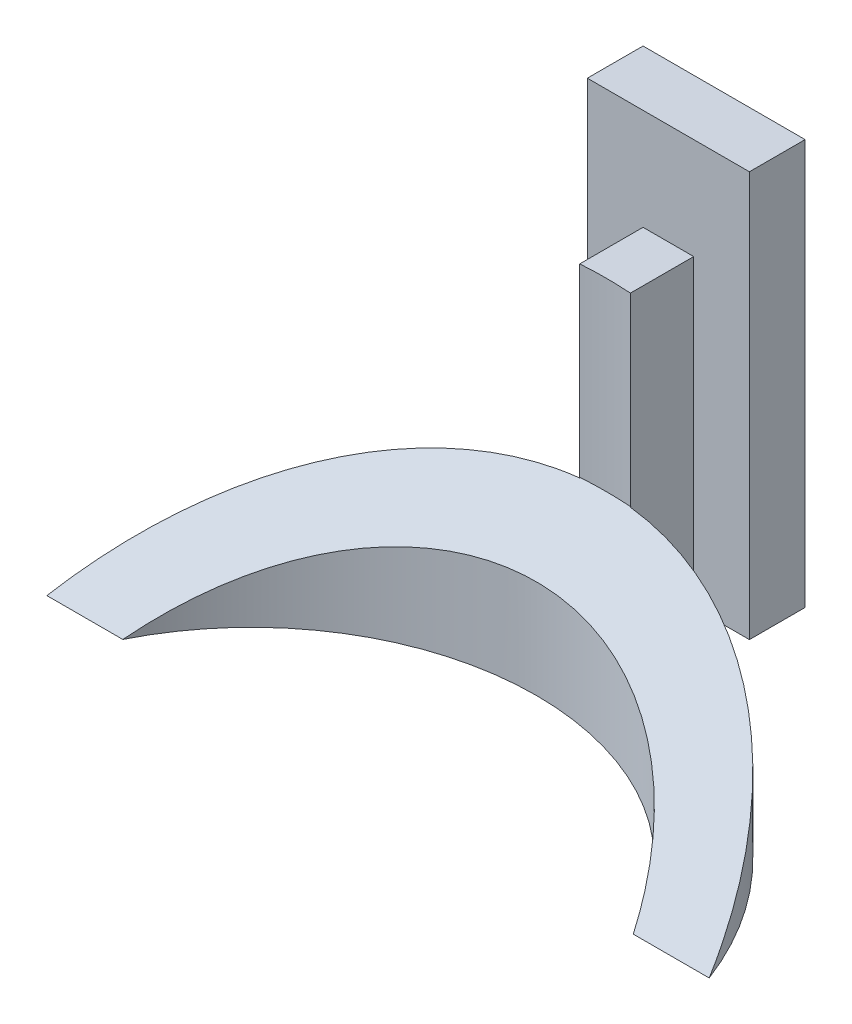
ISO-10303-21;
HEADER;
FILE_DESCRIPTION(('STEP AP214'),'2;1');
FILE_NAME('part.step','',(''),(''),'','','');
FILE_SCHEMA(('AUTOMOTIVE_DESIGN { 1 0 10303 214 1 1 1 1 }'));
ENDSEC;
DATA;
#1=APPLICATION_CONTEXT('core data for automotive mechanical design processes');
#2=APPLICATION_PROTOCOL_DEFINITION('international standard','automotive_design',2000,#1);
#3=PRODUCT_CONTEXT('',#1,'mechanical');
#4=PRODUCT('Part','Part','',(#3));
#5=PRODUCT_RELATED_PRODUCT_CATEGORY('part','',(#4));
#6=PRODUCT_DEFINITION_FORMATION('','',#4);
#7=PRODUCT_DEFINITION_CONTEXT('part definition',#1,'design');
#8=PRODUCT_DEFINITION('design','',#6,#7);
#9=PRODUCT_DEFINITION_SHAPE('','',#8);
#10=(LENGTH_UNIT() NAMED_UNIT(*) SI_UNIT(.MILLI.,.METRE.));
#11=(NAMED_UNIT(*) PLANE_ANGLE_UNIT() SI_UNIT($,.RADIAN.));
#12=(NAMED_UNIT(*) SI_UNIT($,.STERADIAN.) SOLID_ANGLE_UNIT());
#13=UNCERTAINTY_MEASURE_WITH_UNIT(LENGTH_MEASURE(1.E-05),#10,'distance_accuracy_value','');
#14=(GEOMETRIC_REPRESENTATION_CONTEXT(3) GLOBAL_UNCERTAINTY_ASSIGNED_CONTEXT((#13)) GLOBAL_UNIT_ASSIGNED_CONTEXT((#10,
#11,#12)) REPRESENTATION_CONTEXT('',''));
#15=CARTESIAN_POINT('',(0.,0.,0.));
#16=DIRECTION('',(0.,0.,1.));
#17=DIRECTION('',(1.,0.,0.));
#18=AXIS2_PLACEMENT_3D('',#15,#16,#17);
#19=CARTESIAN_POINT('',(-2.5,30.,0.));
#20=DIRECTION('',(1.,0.,0.));
#21=DIRECTION('',(0.,0.,-1.));
#22=AXIS2_PLACEMENT_3D('',#19,#20,#21);
#23=PLANE('',#22);
#24=DIRECTION('',(0.,0.,1.));
#25=VECTOR('',#24,1.);
#26=CARTESIAN_POINT('',(-2.5,30.,0.));
#27=LINE('',#26,#25);
#28=CARTESIAN_POINT('',(-2.5,30.,3.));
#29=VERTEX_POINT('',#28);
#30=CARTESIAN_POINT('',(-2.5,30.,9.25));
#31=VERTEX_POINT('',#30);
#32=EDGE_CURVE('E97',#29,#31,#27,.T.);
#33=ORIENTED_EDGE('',*,*,#32,.F.);
#34=DIRECTION('',(0.,-1.,0.));
#35=VECTOR('',#34,1.);
#36=CARTESIAN_POINT('',(-2.5,30.,3.));
#37=LINE('',#36,#35);
#38=CARTESIAN_POINT('',(-2.5,0.,3.));
#39=VERTEX_POINT('',#38);
#40=EDGE_CURVE('E180',#29,#39,#37,.T.);
#41=ORIENTED_EDGE('',*,*,#40,.T.);
#42=DIRECTION('',(0.,0.,1.));
#43=VECTOR('',#42,1.);
#44=CARTESIAN_POINT('',(-2.5,0.,0.));
#45=LINE('',#44,#43);
#46=CARTESIAN_POINT('',(-2.5,0.,9.25));
#47=VERTEX_POINT('',#46);
#48=EDGE_CURVE('E104',#39,#47,#45,.T.);
#49=ORIENTED_EDGE('',*,*,#48,.T.);
#50=DIRECTION('',(0.,-1.,0.));
#51=VECTOR('',#50,1.);
#52=CARTESIAN_POINT('',(-2.5,11.7500000000677,9.25));
#53=LINE('',#52,#51);
#54=CARTESIAN_POINT('',(-2.5,11.6943734014861,9.25));
#55=VERTEX_POINT('',#54);
#56=EDGE_CURVE('E105',#55,#47,#53,.T.);
#57=ORIENTED_EDGE('',*,*,#56,.F.);
#58=DIRECTION('',(0.,0.528301886792453,-0.849056603773585));
#59=VECTOR('',#58,1.);
#60=CARTESIAN_POINT('',(-2.5,20.9526899743715,-5.62943734927998));
#61=LINE('',#60,#59);
#62=CARTESIAN_POINT('',(-2.5,11.7500000000678,9.16060010942235));
#63=VERTEX_POINT('',#62);
#64=EDGE_CURVE('E199',#55,#63,#61,.T.);
#65=ORIENTED_EDGE('',*,*,#64,.T.);
#66=DIRECTION('',(0.,0.,-1.));
#67=VECTOR('',#66,1.);
#68=CARTESIAN_POINT('',(-2.5,11.7500000000678,0.));
#69=LINE('',#68,#67);
#70=CARTESIAN_POINT('',(-2.5,11.7500000000678,9.24999999999999));
#71=VERTEX_POINT('',#70);
#72=EDGE_CURVE('E203',#71,#63,#69,.T.);
#73=ORIENTED_EDGE('',*,*,#72,.F.);
#74=DIRECTION('',(0.,-1.,0.));
#75=VECTOR('',#74,1.);
#76=CARTESIAN_POINT('',(-2.5,30.,9.25));
#77=LINE('',#76,#75);
#78=EDGE_CURVE('E11',#31,#71,#77,.T.);
#79=ORIENTED_EDGE('',*,*,#78,.F.);
#80=EDGE_LOOP('',(#33,#41,#49,#57,#65,#73,#79));
#81=FACE_BOUND('',#80,.T.);
#82=ADVANCED_FACE('F39',(#81),#23,.F.);
#83=CARTESIAN_POINT('',(2.5,30.,0.));
#84=DIRECTION('',(-1.,0.,0.));
#85=DIRECTION('',(0.,0.,1.));
#86=AXIS2_PLACEMENT_3D('',#83,#84,#85);
#87=PLANE('',#86);
#88=DIRECTION('',(0.,0.,-1.));
#89=VECTOR('',#88,1.);
#90=CARTESIAN_POINT('',(2.5,0.,0.));
#91=LINE('',#90,#89);
#92=CARTESIAN_POINT('',(2.5,0.,9.24999999999999));
#93=VERTEX_POINT('',#92);
#94=CARTESIAN_POINT('',(2.5,0.,3.));
#95=VERTEX_POINT('',#94);
#96=EDGE_CURVE('E117',#93,#95,#91,.T.);
#97=ORIENTED_EDGE('',*,*,#96,.T.);
#98=DIRECTION('',(0.,1.,0.));
#99=VECTOR('',#98,1.);
#100=CARTESIAN_POINT('',(2.5,30.,3.));
#101=LINE('',#100,#99);
#102=CARTESIAN_POINT('',(2.5,30.,3.));
#103=VERTEX_POINT('',#102);
#104=EDGE_CURVE('E172',#95,#103,#101,.T.);
#105=ORIENTED_EDGE('',*,*,#104,.T.);
#106=DIRECTION('',(0.,0.,-1.));
#107=VECTOR('',#106,1.);
#108=CARTESIAN_POINT('',(2.5,30.,0.));
#109=LINE('',#108,#107);
#110=CARTESIAN_POINT('',(2.5,30.,9.25));
#111=VERTEX_POINT('',#110);
#112=EDGE_CURVE('E91',#111,#103,#109,.T.);
#113=ORIENTED_EDGE('',*,*,#112,.F.);
#114=DIRECTION('',(0.,-1.,0.));
#115=VECTOR('',#114,1.);
#116=CARTESIAN_POINT('',(2.5,30.,9.25));
#117=LINE('',#116,#115);
#118=CARTESIAN_POINT('',(2.5,11.7500000000678,9.25));
#119=VERTEX_POINT('',#118);
#120=EDGE_CURVE('E48',#111,#119,#117,.T.);
#121=ORIENTED_EDGE('',*,*,#120,.T.);
#122=DIRECTION('',(0.,0.,1.));
#123=VECTOR('',#122,1.);
#124=CARTESIAN_POINT('',(2.5,11.7500000000678,0.));
#125=LINE('',#124,#123);
#126=CARTESIAN_POINT('',(2.5,11.7500000000678,9.16060010942235));
#127=VERTEX_POINT('',#126);
#128=EDGE_CURVE('E128',#127,#119,#125,.T.);
#129=ORIENTED_EDGE('',*,*,#128,.F.);
#130=DIRECTION('',(0.,-0.528301886792453,0.849056603773585));
#131=VECTOR('',#130,1.);
#132=CARTESIAN_POINT('',(2.50000000000001,20.9526899743715,-5.62943734927997));
#133=LINE('',#132,#131);
#134=CARTESIAN_POINT('',(2.5,11.6943734014862,9.24999999999999));
#135=VERTEX_POINT('',#134);
#136=EDGE_CURVE('E157',#127,#135,#133,.T.);
#137=ORIENTED_EDGE('',*,*,#136,.T.);
#138=DIRECTION('',(0.,-1.,0.));
#139=VECTOR('',#138,1.);
#140=CARTESIAN_POINT('',(2.5,11.7500000000677,9.24999999999999));
#141=LINE('',#140,#139);
#142=EDGE_CURVE('E110',#93,#135,#141,.F.);
#143=ORIENTED_EDGE('',*,*,#142,.F.);
#144=EDGE_LOOP('',(#97,#105,#113,#121,#129,#137,#143));
#145=FACE_BOUND('',#144,.T.);
#146=ADVANCED_FACE('F124',(#145),#87,.F.);
#147=CARTESIAN_POINT('',(-8.,30.,0.));
#148=DIRECTION('',(-1.,0.,0.));
#149=DIRECTION('',(0.,0.,1.));
#150=AXIS2_PLACEMENT_3D('',#147,#148,#149);
#151=PLANE('',#150);
#152=DIRECTION('',(0.,0.,-1.));
#153=VECTOR('',#152,1.);
#154=CARTESIAN_POINT('',(-8.,0.,0.));
#155=LINE('',#154,#153);
#156=CARTESIAN_POINT('',(-8.,0.,3.));
#157=VERTEX_POINT('',#156);
#158=CARTESIAN_POINT('',(-8.,0.,-2.5));
#159=VERTEX_POINT('',#158);
#160=EDGE_CURVE('E82',#157,#159,#155,.T.);
#161=ORIENTED_EDGE('',*,*,#160,.F.);
#162=DIRECTION('',(0.,1.,0.));
#163=VECTOR('',#162,1.);
#164=CARTESIAN_POINT('',(-8.,-16.0078105935821,3.));
#165=LINE('',#164,#163);
#166=CARTESIAN_POINT('',(-8.,40.,3.));
#167=VERTEX_POINT('',#166);
#168=EDGE_CURVE('E176',#157,#167,#165,.T.);
#169=ORIENTED_EDGE('',*,*,#168,.T.);
#170=DIRECTION('',(0.,0.,1.));
#171=VECTOR('',#170,1.);
#172=CARTESIAN_POINT('',(-8.,40.,0.));
#173=LINE('',#172,#171);
#174=CARTESIAN_POINT('',(-8.,40.,-2.5));
#175=VERTEX_POINT('',#174);
#176=EDGE_CURVE('E86',#175,#167,#173,.T.);
#177=ORIENTED_EDGE('',*,*,#176,.F.);
#178=DIRECTION('',(0.,-1.,0.));
#179=VECTOR('',#178,1.);
#180=CARTESIAN_POINT('',(-8.,30.,-2.5));
#181=LINE('',#180,#179);
#182=EDGE_CURVE('E77',#175,#159,#181,.T.);
#183=ORIENTED_EDGE('',*,*,#182,.T.);
#184=EDGE_LOOP('',(#161,#169,#177,#183));
#185=FACE_BOUND('',#184,.T.);
#186=ADVANCED_FACE('F41',(#185),#151,.T.);
#187=CARTESIAN_POINT('',(0.,30.,44.1606001094224));
#188=DIRECTION('',(0.,-1.,0.));
#189=DIRECTION('',(0.,0.,-1.));
#190=AXIS2_PLACEMENT_3D('',#187,#188,#189);
#191=CYLINDRICAL_SURFACE('',#190,35.);
#192=CARTESIAN_POINT('',(0.,11.7500000000677,44.1606001094224));
#193=DIRECTION('',(0.,1.,0.));
#194=DIRECTION('',(0.,0.,1.));
#195=AXIS2_PLACEMENT_3D('',#192,#193,#194);
#196=CIRCLE('',#195,35.);
#197=CARTESIAN_POINT('',(0.,11.7500000000678,9.16060010942235));
#198=VERTEX_POINT('',#197);
#199=EDGE_CURVE('E158',#119,#198,#196,.T.);
#200=ORIENTED_EDGE('',*,*,#199,.F.);
#201=ORIENTED_EDGE('',*,*,#120,.F.);
#202=CARTESIAN_POINT('',(0.,30.,44.1606001094224));
#203=DIRECTION('',(0.,1.,0.));
#204=DIRECTION('',(0.,0.,1.));
#205=AXIS2_PLACEMENT_3D('',#202,#203,#204);
#206=CIRCLE('',#205,35.);
#207=EDGE_CURVE('E219',#111,#31,#206,.T.);
#208=ORIENTED_EDGE('',*,*,#207,.T.);
#209=ORIENTED_EDGE('',*,*,#78,.T.);
#210=EDGE_CURVE('E207',#198,#71,#196,.T.);
#211=ORIENTED_EDGE('',*,*,#210,.F.);
#212=EDGE_LOOP('',(#200,#201,#208,#209,#211));
#213=FACE_BOUND('',#212,.T.);
#214=ADVANCED_FACE('F272',(#213),#191,.F.);
#215=CARTESIAN_POINT('',(8.,30.,0.));
#216=DIRECTION('',(-1.,0.,0.));
#217=DIRECTION('',(0.,0.,1.));
#218=AXIS2_PLACEMENT_3D('',#215,#216,#217);
#219=PLANE('',#218);
#220=DIRECTION('',(0.,0.,-1.));
#221=VECTOR('',#220,1.);
#222=CARTESIAN_POINT('',(8.,0.,0.));
#223=LINE('',#222,#221);
#224=CARTESIAN_POINT('',(8.,0.,3.));
#225=VERTEX_POINT('',#224);
#226=CARTESIAN_POINT('',(8.,0.,-2.5));
#227=VERTEX_POINT('',#226);
#228=EDGE_CURVE('E70',#225,#227,#223,.T.);
#229=ORIENTED_EDGE('',*,*,#228,.T.);
#230=DIRECTION('',(0.,-1.,0.));
#231=VECTOR('',#230,1.);
#232=CARTESIAN_POINT('',(8.,30.,-2.5));
#233=LINE('',#232,#231);
#234=CARTESIAN_POINT('',(8.,40.,-2.5));
#235=VERTEX_POINT('',#234);
#236=EDGE_CURVE('E90',#235,#227,#233,.T.);
#237=ORIENTED_EDGE('',*,*,#236,.F.);
#238=DIRECTION('',(0.,0.,1.));
#239=VECTOR('',#238,1.);
#240=CARTESIAN_POINT('',(8.,40.,0.));
#241=LINE('',#240,#239);
#242=CARTESIAN_POINT('',(8.,40.,3.));
#243=VERTEX_POINT('',#242);
#244=EDGE_CURVE('E183',#235,#243,#241,.T.);
#245=ORIENTED_EDGE('',*,*,#244,.T.);
#246=DIRECTION('',(0.,1.,0.));
#247=VECTOR('',#246,1.);
#248=CARTESIAN_POINT('',(8.,-16.0078105935821,3.));
#249=LINE('',#248,#247);
#250=EDGE_CURVE('E174',#225,#243,#249,.T.);
#251=ORIENTED_EDGE('',*,*,#250,.F.);
#252=EDGE_LOOP('',(#229,#237,#245,#251));
#253=FACE_BOUND('',#252,.T.);
#254=ADVANCED_FACE('F270',(#253),#219,.F.);
#255=CARTESIAN_POINT('',(0.,30.,-2.5));
#256=DIRECTION('',(0.,0.,1.));
#257=DIRECTION('',(1.,0.,0.));
#258=AXIS2_PLACEMENT_3D('',#255,#256,#257);
#259=PLANE('',#258);
#260=DIRECTION('',(-1.,0.,0.));
#261=VECTOR('',#260,1.);
#262=CARTESIAN_POINT('',(0.,0.,-2.5));
#263=LINE('',#262,#261);
#264=EDGE_CURVE('E94',#227,#159,#263,.T.);
#265=ORIENTED_EDGE('',*,*,#264,.T.);
#266=ORIENTED_EDGE('',*,*,#182,.F.);
#267=DIRECTION('',(1.,0.,0.));
#268=VECTOR('',#267,1.);
#269=CARTESIAN_POINT('',(0.,40.,-2.5));
#270=LINE('',#269,#268);
#271=EDGE_CURVE('E187',#175,#235,#270,.T.);
#272=ORIENTED_EDGE('',*,*,#271,.T.);
#273=ORIENTED_EDGE('',*,*,#236,.T.);
#274=EDGE_LOOP('',(#265,#266,#272,#273));
#275=FACE_BOUND('',#274,.T.);
#276=ADVANCED_FACE('F95',(#275),#259,.F.);
#277=CARTESIAN_POINT('',(0.,30.,0.));
#278=DIRECTION('',(0.,1.,0.));
#279=DIRECTION('',(0.,0.,1.));
#280=AXIS2_PLACEMENT_3D('',#277,#278,#279);
#281=PLANE('',#280);
#282=DIRECTION('',(1.,0.,0.));
#283=VECTOR('',#282,1.);
#284=CARTESIAN_POINT('',(0.,30.,3.));
#285=LINE('',#284,#283);
#286=EDGE_CURVE('E169',#29,#103,#285,.T.);
#287=ORIENTED_EDGE('',*,*,#286,.F.);
#288=ORIENTED_EDGE('',*,*,#32,.T.);
#289=ORIENTED_EDGE('',*,*,#207,.F.);
#290=ORIENTED_EDGE('',*,*,#112,.T.);
#291=EDGE_LOOP('',(#287,#288,#289,#290));
#292=FACE_BOUND('',#291,.T.);
#293=ADVANCED_FACE('F223',(#292),#281,.T.);
#294=CARTESIAN_POINT('',(0.,0.,0.));
#295=DIRECTION('',(0.,1.,0.));
#296=DIRECTION('',(0.,0.,1.));
#297=AXIS2_PLACEMENT_3D('',#294,#295,#296);
#298=PLANE('',#297);
#299=ORIENTED_EDGE('',*,*,#48,.F.);
#300=DIRECTION('',(-1.,0.,0.));
#301=VECTOR('',#300,1.);
#302=CARTESIAN_POINT('',(8.,0.,3.));
#303=LINE('',#302,#301);
#304=EDGE_CURVE('E102',#39,#157,#303,.T.);
#305=ORIENTED_EDGE('',*,*,#304,.T.);
#306=ORIENTED_EDGE('',*,*,#160,.T.);
#307=ORIENTED_EDGE('',*,*,#264,.F.);
#308=ORIENTED_EDGE('',*,*,#228,.F.);
#309=EDGE_CURVE('E162',#225,#95,#303,.T.);
#310=ORIENTED_EDGE('',*,*,#309,.T.);
#311=ORIENTED_EDGE('',*,*,#96,.F.);
#312=CARTESIAN_POINT('',(0.,0.,44.1606001094224));
#313=DIRECTION('',(0.,1.,0.));
#314=DIRECTION('',(0.,0.,1.));
#315=AXIS2_PLACEMENT_3D('',#312,#313,#314);
#316=CIRCLE('',#315,35.);
#317=EDGE_CURVE('E107',#93,#47,#316,.T.);
#318=ORIENTED_EDGE('',*,*,#317,.T.);
#319=EDGE_LOOP('',(#299,#305,#306,#307,#308,#310,#311,#318));
#320=FACE_BOUND('',#319,.T.);
#321=ADVANCED_FACE('F100',(#320),#298,.F.);
#322=CARTESIAN_POINT('',(0.,11.7500000000677,44.1606001094224));
#323=DIRECTION('',(0.,-1.,0.));
#324=DIRECTION('',(0.,0.,-1.));
#325=AXIS2_PLACEMENT_3D('',#322,#323,#324);
#326=CYLINDRICAL_SURFACE('',#325,35.);
#327=CARTESIAN_POINT('',(0.,-2.24999999993229,44.1606001094224));
#328=DIRECTION('',(0.,1.,0.));
#329=DIRECTION('',(0.,0.,1.));
#330=AXIS2_PLACEMENT_3D('',#327,#328,#329);
#331=CIRCLE('',#330,35.);
#332=CARTESIAN_POINT('',(32.6917420765551,-2.2499999999322,31.6606001094223));
#333=VERTEX_POINT('',#332);
#334=CARTESIAN_POINT('',(-32.691742076555,-2.2499999999322,31.6606001094224));
#335=VERTEX_POINT('',#334);
#336=EDGE_CURVE('E215',#333,#335,#331,.T.);
#337=ORIENTED_EDGE('',*,*,#336,.T.);
#338=CARTESIAN_POINT('',(0.,-10.02777777771,44.1606001094224));
#339=DIRECTION('',(0.,-0.849056603773585,-0.528301886792453));
#340=DIRECTION('',(0.,-0.528301886792453,0.849056603773585));
#341=AXIS2_PLACEMENT_3D('',#338,#339,#340);
#342=ELLIPSE('',#341,41.2222222222222,35.);
#343=EDGE_CURVE('E197',#335,#55,#342,.T.);
#344=ORIENTED_EDGE('',*,*,#343,.T.);
#345=ORIENTED_EDGE('',*,*,#56,.T.);
#346=ORIENTED_EDGE('',*,*,#317,.F.);
#347=ORIENTED_EDGE('',*,*,#142,.T.);
#348=EDGE_CURVE('E195',#135,#333,#342,.T.);
#349=ORIENTED_EDGE('',*,*,#348,.T.);
#350=EDGE_LOOP('',(#337,#344,#345,#346,#347,#349));
#351=FACE_BOUND('',#350,.T.);
#352=ADVANCED_FACE('F149',(#351),#326,.T.);
#353=CARTESIAN_POINT('',(0.,11.7500000000677,44.1606001094224));
#354=DIRECTION('',(0.,-1.,0.));
#355=DIRECTION('',(0.,0.,-1.));
#356=AXIS2_PLACEMENT_3D('',#353,#354,#355);
#357=CYLINDRICAL_SURFACE('',#356,28.125);
#358=CARTESIAN_POINT('',(0.,-10.02777777771,44.1606001094224));
#359=DIRECTION('',(0.,-0.849056603773585,-0.528301886792453));
#360=DIRECTION('',(0.,-0.528301886792453,0.849056603773585));
#361=AXIS2_PLACEMENT_3D('',#358,#359,#360);
#362=ELLIPSE('',#361,33.125,28.125);
#363=CARTESIAN_POINT('',(-25.194555463433,-2.2499999999322,31.6606001094223));
#364=VERTEX_POINT('',#363);
#365=CARTESIAN_POINT('',(25.194555463433,-2.2499999999322,31.6606001094223));
#366=VERTEX_POINT('',#365);
#367=EDGE_CURVE('E192',#364,#366,#362,.T.);
#368=ORIENTED_EDGE('',*,*,#367,.F.);
#369=CARTESIAN_POINT('',(0.,-2.24999999993229,44.1606001094224));
#370=DIRECTION('',(0.,1.,0.));
#371=DIRECTION('',(0.,0.,1.));
#372=AXIS2_PLACEMENT_3D('',#369,#370,#371);
#373=CIRCLE('',#372,28.125);
#374=EDGE_CURVE('E206',#366,#364,#373,.T.);
#375=ORIENTED_EDGE('',*,*,#374,.F.);
#376=EDGE_LOOP('',(#368,#375));
#377=FACE_BOUND('',#376,.T.);
#378=ADVANCED_FACE('F306',(#377),#357,.F.);
#379=CARTESIAN_POINT('',(0.,-2.24999999993229,44.1606001094224));
#380=DIRECTION('',(0.,1.,0.));
#381=DIRECTION('',(0.,0.,1.));
#382=AXIS2_PLACEMENT_3D('',#379,#380,#381);
#383=PLANE('',#382);
#384=ORIENTED_EDGE('',*,*,#374,.T.);
#385=DIRECTION('',(1.,0.,0.));
#386=VECTOR('',#385,1.);
#387=CARTESIAN_POINT('',(3.99679923771734E-12,-2.2499999999322,31.6606001094224));
#388=LINE('',#387,#386);
#389=EDGE_CURVE('E212',#335,#364,#388,.T.);
#390=ORIENTED_EDGE('',*,*,#389,.F.);
#391=ORIENTED_EDGE('',*,*,#336,.F.);
#392=DIRECTION('',(1.,0.,0.));
#393=VECTOR('',#392,1.);
#394=CARTESIAN_POINT('',(3.99679923771734E-12,-2.2499999999322,31.6606001094224));
#395=LINE('',#394,#393);
#396=EDGE_CURVE('E209',#366,#333,#395,.T.);
#397=ORIENTED_EDGE('',*,*,#396,.F.);
#398=EDGE_LOOP('',(#384,#390,#391,#397));
#399=FACE_BOUND('',#398,.T.);
#400=ADVANCED_FACE('F318',(#399),#383,.F.);
#401=CARTESIAN_POINT('',(-32.691742076555,11.7500000000678,0.));
#402=DIRECTION('',(0.,-1.,0.));
#403=DIRECTION('',(0.,0.,-1.));
#404=AXIS2_PLACEMENT_3D('',#401,#402,#403);
#405=PLANE('',#404);
#406=ORIENTED_EDGE('',*,*,#72,.T.);
#407=DIRECTION('',(1.,0.,0.));
#408=VECTOR('',#407,1.);
#409=CARTESIAN_POINT('',(-32.691742076555,11.7500000000678,9.16060010942235));
#410=LINE('',#409,#408);
#411=EDGE_CURVE('E191',#63,#198,#410,.T.);
#412=ORIENTED_EDGE('',*,*,#411,.T.);
#413=ORIENTED_EDGE('',*,*,#210,.T.);
#414=EDGE_LOOP('',(#406,#412,#413));
#415=FACE_BOUND('',#414,.T.);
#416=ADVANCED_FACE('F329',(#415),#405,.T.);
#417=ORIENTED_EDGE('',*,*,#128,.T.);
#418=ORIENTED_EDGE('',*,*,#199,.T.);
#419=EDGE_CURVE('E189',#198,#127,#410,.T.);
#420=ORIENTED_EDGE('',*,*,#419,.T.);
#421=EDGE_LOOP('',(#417,#418,#420));
#422=FACE_BOUND('',#421,.T.);
#423=ADVANCED_FACE('F341',(#422),#405,.T.);
#424=CARTESIAN_POINT('',(-32.691742076555,12.5796034667175,7.82730882373533));
#425=DIRECTION('',(0.,-0.849056603773585,-0.528301886792453));
#426=DIRECTION('',(0.,0.528301886792453,-0.849056603773585));
#427=AXIS2_PLACEMENT_3D('',#424,#425,#426);
#428=PLANE('',#427);
#429=ORIENTED_EDGE('',*,*,#343,.F.);
#430=ORIENTED_EDGE('',*,*,#389,.T.);
#431=ORIENTED_EDGE('',*,*,#367,.T.);
#432=ORIENTED_EDGE('',*,*,#396,.T.);
#433=ORIENTED_EDGE('',*,*,#348,.F.);
#434=ORIENTED_EDGE('',*,*,#136,.F.);
#435=ORIENTED_EDGE('',*,*,#419,.F.);
#436=ORIENTED_EDGE('',*,*,#411,.F.);
#437=ORIENTED_EDGE('',*,*,#64,.F.);
#438=EDGE_LOOP('',(#429,#430,#431,#432,#433,#434,#435,#436,#437));
#439=FACE_BOUND('',#438,.T.);
#440=ADVANCED_FACE('F249',(#439),#428,.F.);
#441=CARTESIAN_POINT('',(0.,40.,0.));
#442=DIRECTION('',(0.,1.,0.));
#443=DIRECTION('',(0.,0.,1.));
#444=AXIS2_PLACEMENT_3D('',#441,#442,#443);
#445=PLANE('',#444);
#446=ORIENTED_EDGE('',*,*,#244,.F.);
#447=ORIENTED_EDGE('',*,*,#271,.F.);
#448=ORIENTED_EDGE('',*,*,#176,.T.);
#449=DIRECTION('',(1.,0.,0.));
#450=VECTOR('',#449,1.);
#451=CARTESIAN_POINT('',(8.,40.,3.));
#452=LINE('',#451,#450);
#453=EDGE_CURVE('E267',#167,#243,#452,.T.);
#454=ORIENTED_EDGE('',*,*,#453,.T.);
#455=EDGE_LOOP('',(#446,#447,#448,#454));
#456=FACE_BOUND('',#455,.T.);
#457=ADVANCED_FACE('F265',(#456),#445,.T.);
#458=CARTESIAN_POINT('',(8.,-16.0078105935821,3.));
#459=DIRECTION('',(0.,0.,1.));
#460=DIRECTION('',(1.,0.,0.));
#461=AXIS2_PLACEMENT_3D('',#458,#459,#460);
#462=PLANE('',#461);
#463=ORIENTED_EDGE('',*,*,#40,.F.);
#464=ORIENTED_EDGE('',*,*,#286,.T.);
#465=ORIENTED_EDGE('',*,*,#104,.F.);
#466=ORIENTED_EDGE('',*,*,#309,.F.);
#467=ORIENTED_EDGE('',*,*,#250,.T.);
#468=ORIENTED_EDGE('',*,*,#453,.F.);
#469=ORIENTED_EDGE('',*,*,#168,.F.);
#470=ORIENTED_EDGE('',*,*,#304,.F.);
#471=EDGE_LOOP('',(#463,#464,#465,#466,#467,#468,#469,#470));
#472=FACE_BOUND('',#471,.T.);
#473=ADVANCED_FACE('F268',(#472),#462,.T.);
#474=CLOSED_SHELL('',(#82,#146,#186,#214,#254,#276,#293,#321,#352,#378,#400,#416,#423,#440,#457,#473));
#475=MANIFOLD_SOLID_BREP('B2',#474);
#476=ADVANCED_BREP_SHAPE_REPRESENTATION('',(#18,#475),#14);
#477=SHAPE_DEFINITION_REPRESENTATION(#9,#476);
ENDSEC;
END-ISO-10303-21;
